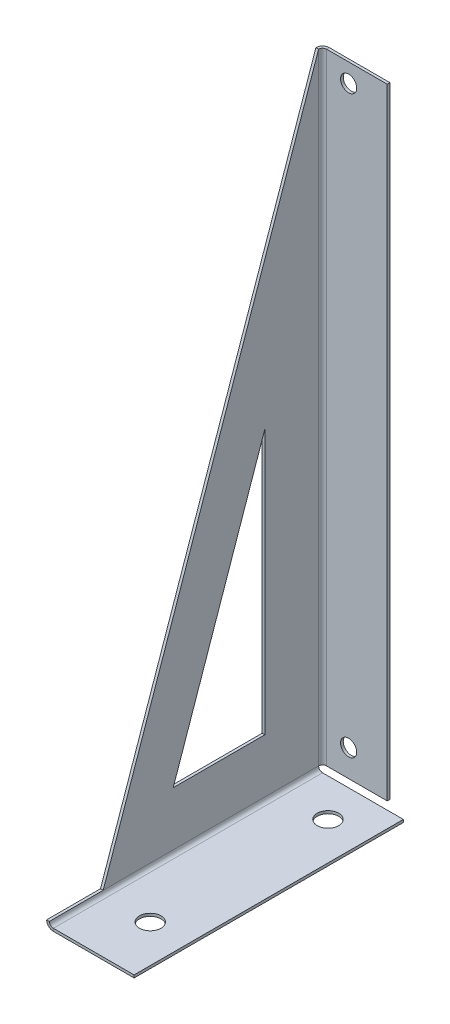
ISO-10303-21;
HEADER;
FILE_DESCRIPTION(('STEP AP214'),'2;1');
FILE_NAME('part.step','',(''),(''),'','','');
FILE_SCHEMA(('AUTOMOTIVE_DESIGN { 1 0 10303 214 1 1 1 1 }'));
ENDSEC;
DATA;
#1=APPLICATION_CONTEXT('core data for automotive mechanical design processes');
#2=APPLICATION_PROTOCOL_DEFINITION('international standard','automotive_design',2000,#1);
#3=PRODUCT_CONTEXT('',#1,'mechanical');
#4=PRODUCT('Part','Part','',(#3));
#5=PRODUCT_RELATED_PRODUCT_CATEGORY('part','',(#4));
#6=PRODUCT_DEFINITION_FORMATION('','',#4);
#7=PRODUCT_DEFINITION_CONTEXT('part definition',#1,'design');
#8=PRODUCT_DEFINITION('design','',#6,#7);
#9=PRODUCT_DEFINITION_SHAPE('','',#8);
#10=(LENGTH_UNIT() NAMED_UNIT(*) SI_UNIT(.MILLI.,.METRE.));
#11=(NAMED_UNIT(*) PLANE_ANGLE_UNIT() SI_UNIT($,.RADIAN.));
#12=(NAMED_UNIT(*) SI_UNIT($,.STERADIAN.) SOLID_ANGLE_UNIT());
#13=UNCERTAINTY_MEASURE_WITH_UNIT(LENGTH_MEASURE(1.E-05),#10,'distance_accuracy_value','');
#14=(GEOMETRIC_REPRESENTATION_CONTEXT(3) GLOBAL_UNCERTAINTY_ASSIGNED_CONTEXT((#13)) GLOBAL_UNIT_ASSIGNED_CONTEXT((#10,
#11,#12)) REPRESENTATION_CONTEXT('',''));
#15=CARTESIAN_POINT('',(0.,0.,0.));
#16=DIRECTION('',(0.,0.,1.));
#17=DIRECTION('',(1.,0.,0.));
#18=AXIS2_PLACEMENT_3D('',#15,#16,#17);
#19=CARTESIAN_POINT('',(-16.2366,0.,0.));
#20=DIRECTION('',(1.,0.,0.));
#21=DIRECTION('',(0.,1.,0.));
#22=AXIS2_PLACEMENT_3D('',#19,#20,#21);
#23=PLANE('',#22);
#24=DIRECTION('',(0.,0.,1.));
#25=VECTOR('',#24,1.);
#26=CARTESIAN_POINT('',(-16.2366,10.7366,10.));
#27=LINE('',#26,#25);
#28=CARTESIAN_POINT('',(-16.2366,10.7366,10.));
#29=VERTEX_POINT('',#28);
#30=CARTESIAN_POINT('',(-16.2366,10.7366,27.));
#31=VERTEX_POINT('',#30);
#32=EDGE_CURVE('E192',#29,#31,#27,.T.);
#33=ORIENTED_EDGE('',*,*,#32,.F.);
#34=DIRECTION('',(0.,-1.,0.));
#35=VECTOR('',#34,1.);
#36=CARTESIAN_POINT('',(-16.2366,10.7366,10.));
#37=LINE('',#36,#35);
#38=CARTESIAN_POINT('',(-16.2366000000002,59.8510916056831,10.));
#39=VERTEX_POINT('',#38);
#40=EDGE_CURVE('E91',#39,#29,#37,.T.);
#41=ORIENTED_EDGE('',*,*,#40,.F.);
#42=DIRECTION('',(0.,0.944993032891379,-0.32709045811022));
#43=VECTOR('',#42,1.);
#44=CARTESIAN_POINT('',(-16.2366000000002,59.8510916056831,10.));
#45=LINE('',#44,#43);
#46=EDGE_CURVE('E185',#31,#39,#45,.T.);
#47=ORIENTED_EDGE('',*,*,#46,.F.);
#48=EDGE_LOOP('',(#33,#41,#47));
#49=FACE_BOUND('',#48,.T.);
#50=DIRECTION('',(0.,0.944729559802012,-0.327850665450442));
#51=VECTOR('',#50,1.);
#52=CARTESIAN_POINT('',(-16.2366,12.4683828250105,35.9287049228079));
#53=LINE('',#52,#51);
#54=CARTESIAN_POINT('',(-16.2366,0.7366,40.));
#55=VERTEX_POINT('',#54);
#56=CARTESIAN_POINT('',(-16.2366000000003,116.,0.));
#57=VERTEX_POINT('',#56);
#58=EDGE_CURVE('E245',#55,#57,#53,.T.);
#59=ORIENTED_EDGE('',*,*,#58,.T.);
#60=DIRECTION('',(0.,-1.,0.));
#61=VECTOR('',#60,1.);
#62=CARTESIAN_POINT('',(-16.2366,0.,0.));
#63=LINE('',#62,#61);
#64=CARTESIAN_POINT('',(-16.2366,0.736599999999995,0.));
#65=VERTEX_POINT('',#64);
#66=EDGE_CURVE('E260',#57,#65,#63,.T.);
#67=ORIENTED_EDGE('',*,*,#66,.T.);
#68=DIRECTION('',(0.,0.,1.));
#69=VECTOR('',#68,1.);
#70=CARTESIAN_POINT('',(-16.2366,0.736599999999995,0.));
#71=LINE('',#70,#69);
#72=EDGE_CURVE('E268',#55,#65,#71,.F.);
#73=ORIENTED_EDGE('',*,*,#72,.F.);
#74=EDGE_LOOP('',(#59,#67,#73));
#75=FACE_BOUND('',#74,.T.);
#76=ADVANCED_FACE('F75',(#49,#75),#23,.F.);
#77=CARTESIAN_POINT('',(-15.7366,0.,0.));
#78=DIRECTION('',(1.,0.,0.));
#79=DIRECTION('',(0.,1.,0.));
#80=AXIS2_PLACEMENT_3D('',#77,#78,#79);
#81=PLANE('',#80);
#82=DIRECTION('',(0.,1.,0.));
#83=VECTOR('',#82,1.);
#84=CARTESIAN_POINT('',(-15.7366,0.,10.));
#85=LINE('',#84,#83);
#86=CARTESIAN_POINT('',(-15.7366,10.7366,10.));
#87=VERTEX_POINT('',#86);
#88=CARTESIAN_POINT('',(-15.7366000000001,59.8510916056831,10.));
#89=VERTEX_POINT('',#88);
#90=EDGE_CURVE('E13',#87,#89,#85,.T.);
#91=ORIENTED_EDGE('',*,*,#90,.F.);
#92=DIRECTION('',(0.,0.,-1.));
#93=VECTOR('',#92,1.);
#94=CARTESIAN_POINT('',(-15.7366,10.7366,0.));
#95=LINE('',#94,#93);
#96=CARTESIAN_POINT('',(-15.7366,10.7366,27.));
#97=VERTEX_POINT('',#96);
#98=EDGE_CURVE('E315',#97,#87,#95,.T.);
#99=ORIENTED_EDGE('',*,*,#98,.F.);
#100=DIRECTION('',(0.,-0.944993032891379,0.32709045811022));
#101=VECTOR('',#100,1.);
#102=CARTESIAN_POINT('',(-15.7366,9.49434067132322,27.4299832472472));
#103=LINE('',#102,#101);
#104=EDGE_CURVE('E84',#89,#97,#103,.T.);
#105=ORIENTED_EDGE('',*,*,#104,.F.);
#106=EDGE_LOOP('',(#91,#99,#105));
#107=FACE_BOUND('',#106,.T.);
#108=DIRECTION('',(0.,1.,0.));
#109=VECTOR('',#108,1.);
#110=CARTESIAN_POINT('',(-15.7366,0.,0.));
#111=LINE('',#110,#109);
#112=CARTESIAN_POINT('',(-15.7366000000003,116.,0.));
#113=VERTEX_POINT('',#112);
#114=CARTESIAN_POINT('',(-15.7366000000001,0.736600000000004,0.));
#115=VERTEX_POINT('',#114);
#116=EDGE_CURVE('E263',#113,#115,#111,.F.);
#117=ORIENTED_EDGE('',*,*,#116,.F.);
#118=DIRECTION('',(0.,0.944729559802012,-0.327850665450442));
#119=VECTOR('',#118,1.);
#120=CARTESIAN_POINT('',(-15.7366,12.4683828250105,35.9287049228079));
#121=LINE('',#120,#119);
#122=CARTESIAN_POINT('',(-15.7366000000002,0.736600000000002,40.));
#123=VERTEX_POINT('',#122);
#124=EDGE_CURVE('E249',#123,#113,#121,.T.);
#125=ORIENTED_EDGE('',*,*,#124,.F.);
#126=DIRECTION('',(0.,0.,1.));
#127=VECTOR('',#126,1.);
#128=CARTESIAN_POINT('',(-15.7366,0.736599999999997,0.));
#129=LINE('',#128,#127);
#130=EDGE_CURVE('E272',#115,#123,#129,.T.);
#131=ORIENTED_EDGE('',*,*,#130,.F.);
#132=EDGE_LOOP('',(#117,#125,#131));
#133=FACE_BOUND('',#132,.T.);
#134=ADVANCED_FACE('F326',(#107,#133),#81,.T.);
#135=CARTESIAN_POINT('',(-15.,-0.5,0.));
#136=DIRECTION('',(0.,0.,-1.));
#137=DIRECTION('',(-1.,0.,0.));
#138=AXIS2_PLACEMENT_3D('',#135,#136,#137);
#139=PLANE('',#138);
#140=DIRECTION('',(-1.,0.,0.));
#141=VECTOR('',#140,1.);
#142=CARTESIAN_POINT('',(-15.,0.,0.));
#143=LINE('',#142,#141);
#144=CARTESIAN_POINT('',(0.,0.,0.));
#145=VERTEX_POINT('',#144);
#146=CARTESIAN_POINT('',(-15.,0.,0.));
#147=VERTEX_POINT('',#146);
#148=EDGE_CURVE('E293',#145,#147,#143,.T.);
#149=ORIENTED_EDGE('',*,*,#148,.F.);
#150=DIRECTION('',(0.,1.,0.));
#151=VECTOR('',#150,1.);
#152=CARTESIAN_POINT('',(0.,-0.5,0.));
#153=LINE('',#152,#151);
#154=CARTESIAN_POINT('',(0.,-0.5,0.));
#155=VERTEX_POINT('',#154);
#156=EDGE_CURVE('E316',#155,#145,#153,.T.);
#157=ORIENTED_EDGE('',*,*,#156,.F.);
#158=DIRECTION('',(-1.,0.,0.));
#159=VECTOR('',#158,1.);
#160=CARTESIAN_POINT('',(-15.,-0.5,0.));
#161=LINE('',#160,#159);
#162=CARTESIAN_POINT('',(-15.,-0.5,0.));
#163=VERTEX_POINT('',#162);
#164=EDGE_CURVE('E299',#155,#163,#161,.T.);
#165=ORIENTED_EDGE('',*,*,#164,.T.);
#166=DIRECTION('',(0.,1.,0.));
#167=VECTOR('',#166,1.);
#168=CARTESIAN_POINT('',(-15.,-0.5,0.));
#169=LINE('',#168,#167);
#170=EDGE_CURVE('E313',#163,#147,#169,.T.);
#171=ORIENTED_EDGE('',*,*,#170,.T.);
#172=EDGE_LOOP('',(#149,#157,#165,#171));
#173=FACE_BOUND('',#172,.T.);
#174=ADVANCED_FACE('F329',(#173),#139,.T.);
#175=CARTESIAN_POINT('',(0.,-0.5,0.));
#176=DIRECTION('',(1.,0.,0.));
#177=DIRECTION('',(0.,0.,-1.));
#178=AXIS2_PLACEMENT_3D('',#175,#176,#177);
#179=PLANE('',#178);
#180=DIRECTION('',(0.,0.,-1.));
#181=VECTOR('',#180,1.);
#182=CARTESIAN_POINT('',(0.,0.,0.));
#183=LINE('',#182,#181);
#184=CARTESIAN_POINT('',(0.,0.,50.));
#185=VERTEX_POINT('',#184);
#186=EDGE_CURVE('E308',#185,#145,#183,.T.);
#187=ORIENTED_EDGE('',*,*,#186,.F.);
#188=DIRECTION('',(0.,1.,0.));
#189=VECTOR('',#188,1.);
#190=CARTESIAN_POINT('',(0.,-0.5,50.));
#191=LINE('',#190,#189);
#192=CARTESIAN_POINT('',(0.,-0.5,50.));
#193=VERTEX_POINT('',#192);
#194=EDGE_CURVE('E318',#193,#185,#191,.T.);
#195=ORIENTED_EDGE('',*,*,#194,.F.);
#196=DIRECTION('',(0.,0.,-1.));
#197=VECTOR('',#196,1.);
#198=CARTESIAN_POINT('',(0.,-0.5,0.));
#199=LINE('',#198,#197);
#200=EDGE_CURVE('E296',#193,#155,#199,.T.);
#201=ORIENTED_EDGE('',*,*,#200,.T.);
#202=ORIENTED_EDGE('',*,*,#156,.T.);
#203=EDGE_LOOP('',(#187,#195,#201,#202));
#204=FACE_BOUND('',#203,.T.);
#205=ADVANCED_FACE('F369',(#204),#179,.T.);
#206=CARTESIAN_POINT('',(-15.,-0.5,50.));
#207=DIRECTION('',(0.,0.,1.));
#208=DIRECTION('',(1.,0.,0.));
#209=AXIS2_PLACEMENT_3D('',#206,#207,#208);
#210=PLANE('',#209);
#211=DIRECTION('',(1.,0.,0.));
#212=VECTOR('',#211,1.);
#213=CARTESIAN_POINT('',(-15.,0.,50.));
#214=LINE('',#213,#212);
#215=CARTESIAN_POINT('',(-15.,0.,50.));
#216=VERTEX_POINT('',#215);
#217=EDGE_CURVE('E305',#216,#185,#214,.T.);
#218=ORIENTED_EDGE('',*,*,#217,.F.);
#219=DIRECTION('',(0.,1.,0.));
#220=VECTOR('',#219,1.);
#221=CARTESIAN_POINT('',(-15.,-0.5,50.));
#222=LINE('',#221,#220);
#223=CARTESIAN_POINT('',(-15.,-0.500000000000004,50.));
#224=VERTEX_POINT('',#223);
#225=EDGE_CURVE('E302',#224,#216,#222,.T.);
#226=ORIENTED_EDGE('',*,*,#225,.F.);
#227=DIRECTION('',(1.,0.,0.));
#228=VECTOR('',#227,1.);
#229=CARTESIAN_POINT('',(-15.,-0.5,50.));
#230=LINE('',#229,#228);
#231=EDGE_CURVE('E292',#224,#193,#230,.T.);
#232=ORIENTED_EDGE('',*,*,#231,.T.);
#233=ORIENTED_EDGE('',*,*,#194,.T.);
#234=EDGE_LOOP('',(#218,#226,#232,#233));
#235=FACE_BOUND('',#234,.T.);
#236=ADVANCED_FACE('F77',(#235),#210,.T.);
#237=CARTESIAN_POINT('',(0.,-0.5,0.));
#238=DIRECTION('',(0.,1.,0.));
#239=DIRECTION('',(0.,0.,1.));
#240=AXIS2_PLACEMENT_3D('',#237,#238,#239);
#241=PLANE('',#240);
#242=CARTESIAN_POINT('',(-6.99999999999999,-0.5,7.));
#243=DIRECTION('',(0.,1.,0.));
#244=DIRECTION('',(0.,0.,1.));
#245=AXIS2_PLACEMENT_3D('',#242,#243,#244);
#246=CIRCLE('',#245,2.);
#247=CARTESIAN_POINT('',(-6.99999999999999,-0.5,9.));
#248=VERTEX_POINT('',#247);
#249=EDGE_CURVE('E409',#248,#248,#246,.T.);
#250=ORIENTED_EDGE('',*,*,#249,.T.);
#251=EDGE_LOOP('',(#250));
#252=FACE_BOUND('',#251,.T.);
#253=CARTESIAN_POINT('',(-6.99999999999999,-0.5,40.));
#254=DIRECTION('',(0.,1.,0.));
#255=DIRECTION('',(0.,0.,1.));
#256=AXIS2_PLACEMENT_3D('',#253,#254,#255);
#257=CIRCLE('',#256,2.);
#258=CARTESIAN_POINT('',(-6.99999999999999,-0.5,42.));
#259=VERTEX_POINT('',#258);
#260=EDGE_CURVE('E408',#259,#259,#257,.T.);
#261=ORIENTED_EDGE('',*,*,#260,.T.);
#262=EDGE_LOOP('',(#261));
#263=FACE_BOUND('',#262,.T.);
#264=DIRECTION('',(0.,0.,1.));
#265=VECTOR('',#264,1.);
#266=CARTESIAN_POINT('',(-15.,-0.5,0.));
#267=LINE('',#266,#265);
#268=EDGE_CURVE('E289',#163,#224,#267,.T.);
#269=ORIENTED_EDGE('',*,*,#268,.F.);
#270=ORIENTED_EDGE('',*,*,#164,.F.);
#271=ORIENTED_EDGE('',*,*,#200,.F.);
#272=ORIENTED_EDGE('',*,*,#231,.F.);
#273=EDGE_LOOP('',(#269,#270,#271,#272));
#274=FACE_BOUND('',#273,.T.);
#275=ADVANCED_FACE('F364',(#252,#263,#274),#241,.F.);
#276=CARTESIAN_POINT('',(0.,0.,0.));
#277=DIRECTION('',(0.,1.,0.));
#278=DIRECTION('',(0.,0.,1.));
#279=AXIS2_PLACEMENT_3D('',#276,#277,#278);
#280=PLANE('',#279);
#281=CARTESIAN_POINT('',(-6.99999999999999,0.,7.));
#282=DIRECTION('',(0.,1.,0.));
#283=DIRECTION('',(0.,0.,1.));
#284=AXIS2_PLACEMENT_3D('',#281,#282,#283);
#285=CIRCLE('',#284,2.);
#286=CARTESIAN_POINT('',(-6.99999999999999,0.,9.));
#287=VERTEX_POINT('',#286);
#288=EDGE_CURVE('E403',#287,#287,#285,.T.);
#289=ORIENTED_EDGE('',*,*,#288,.F.);
#290=EDGE_LOOP('',(#289));
#291=FACE_BOUND('',#290,.T.);
#292=CARTESIAN_POINT('',(-6.99999999999999,0.,40.));
#293=DIRECTION('',(0.,1.,0.));
#294=DIRECTION('',(0.,0.,1.));
#295=AXIS2_PLACEMENT_3D('',#292,#293,#294);
#296=CIRCLE('',#295,2.);
#297=CARTESIAN_POINT('',(-6.99999999999999,0.,42.));
#298=VERTEX_POINT('',#297);
#299=EDGE_CURVE('E406',#298,#298,#296,.T.);
#300=ORIENTED_EDGE('',*,*,#299,.F.);
#301=EDGE_LOOP('',(#300));
#302=FACE_BOUND('',#301,.T.);
#303=DIRECTION('',(0.,0.,1.));
#304=VECTOR('',#303,1.);
#305=CARTESIAN_POINT('',(-15.,0.,0.));
#306=LINE('',#305,#304);
#307=EDGE_CURVE('E280',#147,#216,#306,.T.);
#308=ORIENTED_EDGE('',*,*,#307,.T.);
#309=ORIENTED_EDGE('',*,*,#217,.T.);
#310=ORIENTED_EDGE('',*,*,#186,.T.);
#311=ORIENTED_EDGE('',*,*,#148,.T.);
#312=EDGE_LOOP('',(#308,#309,#310,#311));
#313=FACE_BOUND('',#312,.T.);
#314=ADVANCED_FACE('F353',(#291,#302,#313),#280,.T.);
#315=CARTESIAN_POINT('',(-15.,0.7366,0.));
#316=DIRECTION('',(0.,0.,-1.));
#317=DIRECTION('',(-1.,0.,0.));
#318=AXIS2_PLACEMENT_3D('',#315,#316,#317);
#319=PLANE('',#318);
#320=DIRECTION('',(1.,0.,0.));
#321=VECTOR('',#320,1.);
#322=CARTESIAN_POINT('',(-16.2366,0.736599999999995,0.));
#323=LINE('',#322,#321);
#324=EDGE_CURVE('E256',#115,#65,#323,.F.);
#325=ORIENTED_EDGE('',*,*,#324,.F.);
#326=CARTESIAN_POINT('',(-15.,0.7366,0.));
#327=DIRECTION('',(0.,0.,1.));
#328=DIRECTION('',(1.,0.,0.));
#329=AXIS2_PLACEMENT_3D('',#326,#327,#328);
#330=CIRCLE('',#329,0.736600000000004);
#331=EDGE_CURVE('E284',#147,#115,#330,.F.);
#332=ORIENTED_EDGE('',*,*,#331,.F.);
#333=ORIENTED_EDGE('',*,*,#170,.F.);
#334=CARTESIAN_POINT('',(-15.,0.7366,0.));
#335=DIRECTION('',(0.,0.,1.));
#336=DIRECTION('',(1.,0.,0.));
#337=AXIS2_PLACEMENT_3D('',#334,#335,#336);
#338=CIRCLE('',#337,1.2366);
#339=EDGE_CURVE('E277',#163,#65,#338,.F.);
#340=ORIENTED_EDGE('',*,*,#339,.T.);
#341=EDGE_LOOP('',(#325,#332,#333,#340));
#342=FACE_BOUND('',#341,.T.);
#343=ADVANCED_FACE('F345',(#342),#319,.T.);
#344=CARTESIAN_POINT('',(-15.,0.7366,50.));
#345=DIRECTION('',(0.,0.,-1.));
#346=DIRECTION('',(-1.,0.,0.));
#347=AXIS2_PLACEMENT_3D('',#344,#345,#346);
#348=PLANE('',#347);
#349=CARTESIAN_POINT('',(-15.,0.7366,50.));
#350=DIRECTION('',(0.,0.,1.));
#351=DIRECTION('',(1.,0.,0.));
#352=AXIS2_PLACEMENT_3D('',#349,#350,#351);
#353=CIRCLE('',#352,0.736600000000004);
#354=CARTESIAN_POINT('',(-15.7366000000002,0.736599999999997,50.));
#355=VERTEX_POINT('',#354);
#356=EDGE_CURVE('E259',#355,#216,#353,.T.);
#357=ORIENTED_EDGE('',*,*,#356,.F.);
#358=DIRECTION('',(1.,0.,0.));
#359=VECTOR('',#358,1.);
#360=CARTESIAN_POINT('',(-15.7366,0.736599999999997,50.));
#361=LINE('',#360,#359);
#362=CARTESIAN_POINT('',(-16.2366,0.736599999999995,50.));
#363=VERTEX_POINT('',#362);
#364=EDGE_CURVE('E269',#355,#363,#361,.F.);
#365=ORIENTED_EDGE('',*,*,#364,.T.);
#366=CARTESIAN_POINT('',(-15.,0.7366,50.));
#367=DIRECTION('',(0.,0.,1.));
#368=DIRECTION('',(1.,0.,0.));
#369=AXIS2_PLACEMENT_3D('',#366,#367,#368);
#370=CIRCLE('',#369,1.2366);
#371=EDGE_CURVE('E281',#363,#224,#370,.T.);
#372=ORIENTED_EDGE('',*,*,#371,.T.);
#373=ORIENTED_EDGE('',*,*,#225,.T.);
#374=EDGE_LOOP('',(#357,#365,#372,#373));
#375=FACE_BOUND('',#374,.T.);
#376=ADVANCED_FACE('F357',(#375),#348,.F.);
#377=CARTESIAN_POINT('',(-15.,0.7366,50.));
#378=DIRECTION('',(0.,0.,1.));
#379=DIRECTION('',(-1.,0.,0.));
#380=AXIS2_PLACEMENT_3D('',#377,#378,#379);
#381=CYLINDRICAL_SURFACE('',#380,1.2366);
#382=ORIENTED_EDGE('',*,*,#268,.T.);
#383=ORIENTED_EDGE('',*,*,#371,.F.);
#384=EDGE_CURVE('E265',#363,#55,#71,.F.);
#385=ORIENTED_EDGE('',*,*,#384,.T.);
#386=ORIENTED_EDGE('',*,*,#72,.T.);
#387=ORIENTED_EDGE('',*,*,#339,.F.);
#388=EDGE_LOOP('',(#382,#383,#385,#386,#387));
#389=FACE_BOUND('',#388,.T.);
#390=ADVANCED_FACE('F361',(#389),#381,.T.);
#391=CARTESIAN_POINT('',(-15.,0.7366,50.));
#392=DIRECTION('',(0.,0.,1.));
#393=DIRECTION('',(-1.,0.,0.));
#394=AXIS2_PLACEMENT_3D('',#391,#392,#393);
#395=CYLINDRICAL_SURFACE('',#394,0.736600000000004);
#396=ORIENTED_EDGE('',*,*,#307,.F.);
#397=ORIENTED_EDGE('',*,*,#331,.T.);
#398=ORIENTED_EDGE('',*,*,#130,.T.);
#399=DIRECTION('',(0.,0.,1.));
#400=VECTOR('',#399,1.);
#401=CARTESIAN_POINT('',(-15.7366,0.736599999999997,0.));
#402=LINE('',#401,#400);
#403=EDGE_CURVE('E236',#123,#355,#402,.T.);
#404=ORIENTED_EDGE('',*,*,#403,.T.);
#405=ORIENTED_EDGE('',*,*,#356,.T.);
#406=EDGE_LOOP('',(#396,#397,#398,#404,#405));
#407=FACE_BOUND('',#406,.T.);
#408=ADVANCED_FACE('F350',(#407),#395,.F.);
#409=CARTESIAN_POINT('',(-15.7366,0.736599999999997,0.));
#410=DIRECTION('',(0.,1.,0.));
#411=DIRECTION('',(0.,0.,1.));
#412=AXIS2_PLACEMENT_3D('',#409,#410,#411);
#413=PLANE('',#412);
#414=ORIENTED_EDGE('',*,*,#364,.F.);
#415=ORIENTED_EDGE('',*,*,#403,.F.);
#416=DIRECTION('',(1.,0.,0.));
#417=VECTOR('',#416,1.);
#418=CARTESIAN_POINT('',(-15.7366000000002,0.736600000000002,40.));
#419=LINE('',#418,#417);
#420=EDGE_CURVE('E248',#123,#55,#419,.F.);
#421=ORIENTED_EDGE('',*,*,#420,.T.);
#422=ORIENTED_EDGE('',*,*,#384,.F.);
#423=EDGE_LOOP('',(#414,#415,#421,#422));
#424=FACE_BOUND('',#423,.T.);
#425=ADVANCED_FACE('F388',(#424),#413,.T.);
#426=CARTESIAN_POINT('',(-15.7366,12.4683828250105,35.9287049228079));
#427=DIRECTION('',(0.,-0.327850665450442,-0.944729559802012));
#428=DIRECTION('',(0.,0.944729559802012,-0.327850665450442));
#429=AXIS2_PLACEMENT_3D('',#426,#427,#428);
#430=PLANE('',#429);
#431=ORIENTED_EDGE('',*,*,#124,.T.);
#432=DIRECTION('',(1.,0.,0.));
#433=VECTOR('',#432,1.);
#434=CARTESIAN_POINT('',(-16.2366000000004,116.,0.));
#435=LINE('',#434,#433);
#436=EDGE_CURVE('E257',#57,#113,#435,.T.);
#437=ORIENTED_EDGE('',*,*,#436,.F.);
#438=ORIENTED_EDGE('',*,*,#58,.F.);
#439=ORIENTED_EDGE('',*,*,#420,.F.);
#440=EDGE_LOOP('',(#431,#437,#438,#439));
#441=FACE_BOUND('',#440,.T.);
#442=ADVANCED_FACE('F381',(#441),#430,.F.);
#443=CARTESIAN_POINT('',(-15.0000000000001,0.736600000000004,0.));
#444=DIRECTION('',(0.,-1.,0.));
#445=DIRECTION('',(1.,0.,0.));
#446=AXIS2_PLACEMENT_3D('',#443,#444,#445);
#447=PLANE('',#446);
#448=DIRECTION('',(0.,0.,1.));
#449=VECTOR('',#448,1.);
#450=CARTESIAN_POINT('',(-15.,0.7366,-1.2366));
#451=LINE('',#450,#449);
#452=CARTESIAN_POINT('',(-15.0000000000001,0.736600000000004,-0.7366));
#453=VERTEX_POINT('',#452);
#454=CARTESIAN_POINT('',(-15.0000000000001,0.736600000000004,-1.2366));
#455=VERTEX_POINT('',#454);
#456=EDGE_CURVE('E201',#453,#455,#451,.F.);
#457=ORIENTED_EDGE('',*,*,#456,.F.);
#458=CARTESIAN_POINT('',(-15.0000000000001,0.736600000000004,0.));
#459=DIRECTION('',(0.,1.,0.));
#460=DIRECTION('',(-1.,0.,0.));
#461=AXIS2_PLACEMENT_3D('',#458,#459,#460);
#462=CIRCLE('',#461,0.736599999999996);
#463=EDGE_CURVE('E240',#115,#453,#462,.F.);
#464=ORIENTED_EDGE('',*,*,#463,.F.);
#465=ORIENTED_EDGE('',*,*,#324,.T.);
#466=CARTESIAN_POINT('',(-15.0000000000001,0.736600000000004,0.));
#467=DIRECTION('',(0.,1.,0.));
#468=DIRECTION('',(-1.,0.,0.));
#469=AXIS2_PLACEMENT_3D('',#466,#467,#468);
#470=CIRCLE('',#469,1.2366);
#471=EDGE_CURVE('E233',#65,#455,#470,.F.);
#472=ORIENTED_EDGE('',*,*,#471,.T.);
#473=EDGE_LOOP('',(#457,#464,#465,#472));
#474=FACE_BOUND('',#473,.T.);
#475=ADVANCED_FACE('F341',(#474),#447,.T.);
#476=CARTESIAN_POINT('',(-15.0000000000003,116.,0.));
#477=DIRECTION('',(0.,-1.,0.));
#478=DIRECTION('',(1.,0.,0.));
#479=AXIS2_PLACEMENT_3D('',#476,#477,#478);
#480=PLANE('',#479);
#481=CARTESIAN_POINT('',(-15.0000000000003,116.,0.));
#482=DIRECTION('',(0.,1.,0.));
#483=DIRECTION('',(-1.,0.,0.));
#484=AXIS2_PLACEMENT_3D('',#481,#482,#483);
#485=CIRCLE('',#484,0.736599999999996);
#486=CARTESIAN_POINT('',(-15.0000000000003,116.,-0.736599999999992));
#487=VERTEX_POINT('',#486);
#488=EDGE_CURVE('E206',#487,#113,#485,.T.);
#489=ORIENTED_EDGE('',*,*,#488,.F.);
#490=DIRECTION('',(0.,0.,1.));
#491=VECTOR('',#490,1.);
#492=CARTESIAN_POINT('',(-15.0000000000004,116.,-0.736600000000001));
#493=LINE('',#492,#491);
#494=CARTESIAN_POINT('',(-15.0000000000004,116.,-1.2366));
#495=VERTEX_POINT('',#494);
#496=EDGE_CURVE('E226',#487,#495,#493,.F.);
#497=ORIENTED_EDGE('',*,*,#496,.T.);
#498=CARTESIAN_POINT('',(-15.0000000000003,116.,0.));
#499=DIRECTION('',(0.,1.,0.));
#500=DIRECTION('',(-1.,0.,0.));
#501=AXIS2_PLACEMENT_3D('',#498,#499,#500);
#502=CIRCLE('',#501,1.2366);
#503=EDGE_CURVE('E237',#495,#57,#502,.T.);
#504=ORIENTED_EDGE('',*,*,#503,.T.);
#505=ORIENTED_EDGE('',*,*,#436,.T.);
#506=EDGE_LOOP('',(#489,#497,#504,#505));
#507=FACE_BOUND('',#506,.T.);
#508=ADVANCED_FACE('F448',(#507),#480,.F.);
#509=CARTESIAN_POINT('',(-15.0000000000003,116.,0.));
#510=DIRECTION('',(0.,1.,0.));
#511=DIRECTION('',(0.,0.,-1.));
#512=AXIS2_PLACEMENT_3D('',#509,#510,#511);
#513=CYLINDRICAL_SURFACE('',#512,1.2366);
#514=ORIENTED_EDGE('',*,*,#66,.F.);
#515=ORIENTED_EDGE('',*,*,#503,.F.);
#516=DIRECTION('',(0.,1.,0.));
#517=VECTOR('',#516,1.);
#518=CARTESIAN_POINT('',(-15.,0.736600000000018,-1.2366));
#519=LINE('',#518,#517);
#520=EDGE_CURVE('E224',#495,#455,#519,.F.);
#521=ORIENTED_EDGE('',*,*,#520,.T.);
#522=ORIENTED_EDGE('',*,*,#471,.F.);
#523=EDGE_LOOP('',(#514,#515,#521,#522));
#524=FACE_BOUND('',#523,.T.);
#525=ADVANCED_FACE('F454',(#524),#513,.T.);
#526=CARTESIAN_POINT('',(-15.0000000000003,116.,0.));
#527=DIRECTION('',(0.,1.,0.));
#528=DIRECTION('',(0.,0.,-1.));
#529=AXIS2_PLACEMENT_3D('',#526,#527,#528);
#530=CYLINDRICAL_SURFACE('',#529,0.736599999999996);
#531=ORIENTED_EDGE('',*,*,#116,.T.);
#532=ORIENTED_EDGE('',*,*,#463,.T.);
#533=DIRECTION('',(0.,1.,0.));
#534=VECTOR('',#533,1.);
#535=CARTESIAN_POINT('',(-15.,0.736600000000018,-0.7366));
#536=LINE('',#535,#534);
#537=EDGE_CURVE('E229',#453,#487,#536,.T.);
#538=ORIENTED_EDGE('',*,*,#537,.T.);
#539=ORIENTED_EDGE('',*,*,#488,.T.);
#540=EDGE_LOOP('',(#531,#532,#538,#539));
#541=FACE_BOUND('',#540,.T.);
#542=ADVANCED_FACE('F336',(#541),#530,.F.);
#543=CARTESIAN_POINT('',(-3.7366000000004,116.,-1.23660000000004));
#544=DIRECTION('',(0.,-1.,0.));
#545=DIRECTION('',(1.,0.,0.));
#546=AXIS2_PLACEMENT_3D('',#543,#544,#545);
#547=PLANE('',#546);
#548=ORIENTED_EDGE('',*,*,#496,.F.);
#549=DIRECTION('',(-1.,0.,0.));
#550=VECTOR('',#549,1.);
#551=CARTESIAN_POINT('',(-3.7366000000004,116.,-0.736600000000041));
#552=LINE('',#551,#550);
#553=CARTESIAN_POINT('',(-3.7366000000004,116.,-0.736600000000041));
#554=VERTEX_POINT('',#553);
#555=EDGE_CURVE('E222',#487,#554,#552,.F.);
#556=ORIENTED_EDGE('',*,*,#555,.T.);
#557=DIRECTION('',(0.,0.,1.));
#558=VECTOR('',#557,1.);
#559=CARTESIAN_POINT('',(-3.7366000000004,116.,-1.23660000000004));
#560=LINE('',#559,#558);
#561=CARTESIAN_POINT('',(-3.7366000000004,116.,-1.23660000000004));
#562=VERTEX_POINT('',#561);
#563=EDGE_CURVE('E203',#562,#554,#560,.T.);
#564=ORIENTED_EDGE('',*,*,#563,.F.);
#565=DIRECTION('',(1.,0.,0.));
#566=VECTOR('',#565,1.);
#567=CARTESIAN_POINT('',(-2.70221252022333E-13,116.,-1.23660000000005));
#568=LINE('',#567,#566);
#569=EDGE_CURVE('E215',#495,#562,#568,.T.);
#570=ORIENTED_EDGE('',*,*,#569,.F.);
#571=EDGE_LOOP('',(#548,#556,#564,#570));
#572=FACE_BOUND('',#571,.T.);
#573=ADVANCED_FACE('F444',(#572),#547,.F.);
#574=CARTESIAN_POINT('',(-15.7366,0.736599999999997,-1.2366));
#575=DIRECTION('',(0.,1.,0.));
#576=DIRECTION('',(-1.,0.,0.));
#577=AXIS2_PLACEMENT_3D('',#574,#575,#576);
#578=PLANE('',#577);
#579=ORIENTED_EDGE('',*,*,#456,.T.);
#580=DIRECTION('',(-1.,0.,0.));
#581=VECTOR('',#580,1.);
#582=CARTESIAN_POINT('',(0.,0.736600000000051,-1.23660000000005));
#583=LINE('',#582,#581);
#584=CARTESIAN_POINT('',(-3.7366,0.736600000000039,-1.23660000000004));
#585=VERTEX_POINT('',#584);
#586=EDGE_CURVE('E210',#585,#455,#583,.T.);
#587=ORIENTED_EDGE('',*,*,#586,.F.);
#588=DIRECTION('',(0.,0.,1.));
#589=VECTOR('',#588,1.);
#590=CARTESIAN_POINT('',(-3.7366,0.736600000000039,-1.23660000000004));
#591=LINE('',#590,#589);
#592=CARTESIAN_POINT('',(-3.7366,0.736600000000039,-0.736600000000041));
#593=VERTEX_POINT('',#592);
#594=EDGE_CURVE('E207',#585,#593,#591,.T.);
#595=ORIENTED_EDGE('',*,*,#594,.T.);
#596=DIRECTION('',(1.,0.,0.));
#597=VECTOR('',#596,1.);
#598=CARTESIAN_POINT('',(-15.7366,0.736599999999997,-0.736599999999997));
#599=LINE('',#598,#597);
#600=EDGE_CURVE('E217',#593,#453,#599,.F.);
#601=ORIENTED_EDGE('',*,*,#600,.T.);
#602=EDGE_LOOP('',(#579,#587,#595,#601));
#603=FACE_BOUND('',#602,.T.);
#604=ADVANCED_FACE('F456',(#603),#578,.F.);
#605=CARTESIAN_POINT('',(0.,0.,-1.23660000000005));
#606=DIRECTION('',(0.,0.,1.));
#607=DIRECTION('',(1.,0.,0.));
#608=AXIS2_PLACEMENT_3D('',#605,#606,#607);
#609=PLANE('',#608);
#610=CARTESIAN_POINT('',(-10.9000000000004,112.5366,-1.23660000000001));
#611=DIRECTION('',(0.,0.,1.));
#612=DIRECTION('',(1.,0.,0.));
#613=AXIS2_PLACEMENT_3D('',#610,#611,#612);
#614=CIRCLE('',#613,1.5);
#615=CARTESIAN_POINT('',(-9.4000000000004,112.5366,-1.23660000000002));
#616=VERTEX_POINT('',#615);
#617=EDGE_CURVE('E420',#616,#616,#614,.T.);
#618=ORIENTED_EDGE('',*,*,#617,.T.);
#619=EDGE_LOOP('',(#618));
#620=FACE_BOUND('',#619,.T.);
#621=CARTESIAN_POINT('',(-10.9000000000001,5.7366,-1.23660000000002));
#622=DIRECTION('',(0.,0.,-1.));
#623=DIRECTION('',(-1.,0.,0.));
#624=AXIS2_PLACEMENT_3D('',#621,#622,#623);
#625=CIRCLE('',#624,1.5);
#626=CARTESIAN_POINT('',(-12.4000000000001,5.7366,-1.23660000000001));
#627=VERTEX_POINT('',#626);
#628=EDGE_CURVE('E423',#627,#627,#625,.T.);
#629=ORIENTED_EDGE('',*,*,#628,.F.);
#630=EDGE_LOOP('',(#629));
#631=FACE_BOUND('',#630,.T.);
#632=ORIENTED_EDGE('',*,*,#520,.F.);
#633=ORIENTED_EDGE('',*,*,#569,.T.);
#634=DIRECTION('',(0.,-1.,0.));
#635=VECTOR('',#634,1.);
#636=CARTESIAN_POINT('',(-3.7366,0.,-1.23660000000004));
#637=LINE('',#636,#635);
#638=EDGE_CURVE('E213',#562,#585,#637,.T.);
#639=ORIENTED_EDGE('',*,*,#638,.T.);
#640=ORIENTED_EDGE('',*,*,#586,.T.);
#641=EDGE_LOOP('',(#632,#633,#639,#640));
#642=FACE_BOUND('',#641,.T.);
#643=ADVANCED_FACE('F435',(#620,#631,#642),#609,.F.);
#644=CARTESIAN_POINT('',(0.,0.,-0.736600000000055));
#645=DIRECTION('',(0.,0.,1.));
#646=DIRECTION('',(1.,0.,0.));
#647=AXIS2_PLACEMENT_3D('',#644,#645,#646);
#648=PLANE('',#647);
#649=CARTESIAN_POINT('',(-10.9000000000004,112.5366,-0.736600000000055));
#650=DIRECTION('',(0.,0.,1.));
#651=DIRECTION('',(1.,0.,0.));
#652=AXIS2_PLACEMENT_3D('',#649,#650,#651);
#653=CIRCLE('',#652,1.5);
#654=CARTESIAN_POINT('',(-9.4000000000004,112.5366,-0.736600000000055));
#655=VERTEX_POINT('',#654);
#656=EDGE_CURVE('E412',#655,#655,#653,.T.);
#657=ORIENTED_EDGE('',*,*,#656,.F.);
#658=EDGE_LOOP('',(#657));
#659=FACE_BOUND('',#658,.T.);
#660=CARTESIAN_POINT('',(-10.9000000000001,5.7366,-0.736600000000014));
#661=DIRECTION('',(0.,0.,1.));
#662=DIRECTION('',(1.,0.,0.));
#663=AXIS2_PLACEMENT_3D('',#660,#661,#662);
#664=CIRCLE('',#663,1.5);
#665=CARTESIAN_POINT('',(-9.40000000000007,5.7366,-0.73660000000002));
#666=VERTEX_POINT('',#665);
#667=EDGE_CURVE('E79',#666,#666,#664,.T.);
#668=ORIENTED_EDGE('',*,*,#667,.F.);
#669=EDGE_LOOP('',(#668));
#670=FACE_BOUND('',#669,.T.);
#671=ORIENTED_EDGE('',*,*,#555,.F.);
#672=ORIENTED_EDGE('',*,*,#537,.F.);
#673=ORIENTED_EDGE('',*,*,#600,.F.);
#674=DIRECTION('',(0.,1.,0.));
#675=VECTOR('',#674,1.);
#676=CARTESIAN_POINT('',(-3.7366,0.736600000000039,-0.736600000000041));
#677=LINE('',#676,#675);
#678=EDGE_CURVE('E220',#554,#593,#677,.F.);
#679=ORIENTED_EDGE('',*,*,#678,.F.);
#680=EDGE_LOOP('',(#671,#672,#673,#679));
#681=FACE_BOUND('',#680,.T.);
#682=ADVANCED_FACE('F431',(#659,#670,#681),#648,.T.);
#683=CARTESIAN_POINT('',(-3.7366,0.736600000000039,-1.23660000000004));
#684=DIRECTION('',(-1.,0.,0.));
#685=DIRECTION('',(0.,0.,1.));
#686=AXIS2_PLACEMENT_3D('',#683,#684,#685);
#687=PLANE('',#686);
#688=ORIENTED_EDGE('',*,*,#678,.T.);
#689=ORIENTED_EDGE('',*,*,#594,.F.);
#690=ORIENTED_EDGE('',*,*,#638,.F.);
#691=ORIENTED_EDGE('',*,*,#563,.T.);
#692=EDGE_LOOP('',(#688,#689,#690,#691));
#693=FACE_BOUND('',#692,.T.);
#694=ADVANCED_FACE('F434',(#693),#687,.F.);
#695=CARTESIAN_POINT('',(-6.23660000000003,10.7366,10.));
#696=DIRECTION('',(0.,0.,-1.));
#697=DIRECTION('',(-1.,0.,0.));
#698=AXIS2_PLACEMENT_3D('',#695,#696,#697);
#699=PLANE('',#698);
#700=ORIENTED_EDGE('',*,*,#90,.T.);
#701=DIRECTION('',(-1.,0.,0.));
#702=VECTOR('',#701,1.);
#703=CARTESIAN_POINT('',(-6.2366000000002,59.8510916056831,10.));
#704=LINE('',#703,#702);
#705=EDGE_CURVE('E188',#89,#39,#704,.T.);
#706=ORIENTED_EDGE('',*,*,#705,.T.);
#707=ORIENTED_EDGE('',*,*,#40,.T.);
#708=DIRECTION('',(-1.,0.,0.));
#709=VECTOR('',#708,1.);
#710=CARTESIAN_POINT('',(-6.23660000000003,10.7366,10.));
#711=LINE('',#710,#709);
#712=EDGE_CURVE('E189',#87,#29,#711,.T.);
#713=ORIENTED_EDGE('',*,*,#712,.F.);
#714=EDGE_LOOP('',(#700,#706,#707,#713));
#715=FACE_BOUND('',#714,.T.);
#716=ADVANCED_FACE('F325',(#715),#699,.F.);
#717=CARTESIAN_POINT('',(-6.2366000000002,59.8510916056831,10.));
#718=DIRECTION('',(0.,0.32709045811022,0.944993032891379));
#719=DIRECTION('',(0.,-0.944993032891379,0.32709045811022));
#720=AXIS2_PLACEMENT_3D('',#717,#718,#719);
#721=PLANE('',#720);
#722=ORIENTED_EDGE('',*,*,#104,.T.);
#723=DIRECTION('',(-1.,0.,0.));
#724=VECTOR('',#723,1.);
#725=CARTESIAN_POINT('',(-6.23660000000003,10.7366,27.));
#726=LINE('',#725,#724);
#727=EDGE_CURVE('E99',#97,#31,#726,.T.);
#728=ORIENTED_EDGE('',*,*,#727,.T.);
#729=ORIENTED_EDGE('',*,*,#46,.T.);
#730=ORIENTED_EDGE('',*,*,#705,.F.);
#731=EDGE_LOOP('',(#722,#728,#729,#730));
#732=FACE_BOUND('',#731,.T.);
#733=ADVANCED_FACE('F182',(#732),#721,.F.);
#734=CARTESIAN_POINT('',(-6.23660000000003,10.7366,10.));
#735=DIRECTION('',(0.,-1.,0.));
#736=DIRECTION('',(1.,0.,0.));
#737=AXIS2_PLACEMENT_3D('',#734,#735,#736);
#738=PLANE('',#737);
#739=ORIENTED_EDGE('',*,*,#98,.T.);
#740=ORIENTED_EDGE('',*,*,#712,.T.);
#741=ORIENTED_EDGE('',*,*,#32,.T.);
#742=ORIENTED_EDGE('',*,*,#727,.F.);
#743=EDGE_LOOP('',(#739,#740,#741,#742));
#744=FACE_BOUND('',#743,.T.);
#745=ADVANCED_FACE('F193',(#744),#738,.F.);
#746=CARTESIAN_POINT('',(-10.9,5.7366,8.76339999999998));
#747=DIRECTION('',(0.,0.,-1.));
#748=DIRECTION('',(-1.,0.,0.));
#749=AXIS2_PLACEMENT_3D('',#746,#747,#748);
#750=CYLINDRICAL_SURFACE('',#749,1.5);
#751=ORIENTED_EDGE('',*,*,#667,.T.);
#752=EDGE_LOOP('',(#751));
#753=FACE_BOUND('',#752,.T.);
#754=ORIENTED_EDGE('',*,*,#628,.T.);
#755=EDGE_LOOP('',(#754));
#756=FACE_BOUND('',#755,.T.);
#757=ADVANCED_FACE('F428',(#753,#756),#750,.F.);
#758=CARTESIAN_POINT('',(-10.9000000000004,112.5366,-10.7366000000001));
#759=DIRECTION('',(0.,0.,1.));
#760=DIRECTION('',(1.,0.,0.));
#761=AXIS2_PLACEMENT_3D('',#758,#759,#760);
#762=CYLINDRICAL_SURFACE('',#761,1.5);
#763=ORIENTED_EDGE('',*,*,#656,.T.);
#764=EDGE_LOOP('',(#763));
#765=FACE_BOUND('',#764,.T.);
#766=ORIENTED_EDGE('',*,*,#617,.F.);
#767=EDGE_LOOP('',(#766));
#768=FACE_BOUND('',#767,.T.);
#769=ADVANCED_FACE('F531',(#765,#768),#762,.F.);
#770=CARTESIAN_POINT('',(-6.99999999999999,-12.,40.));
#771=DIRECTION('',(0.,1.,0.));
#772=DIRECTION('',(0.,0.,1.));
#773=AXIS2_PLACEMENT_3D('',#770,#771,#772);
#774=CYLINDRICAL_SURFACE('',#773,2.);
#775=ORIENTED_EDGE('',*,*,#299,.T.);
#776=EDGE_LOOP('',(#775));
#777=FACE_BOUND('',#776,.T.);
#778=ORIENTED_EDGE('',*,*,#260,.F.);
#779=EDGE_LOOP('',(#778));
#780=FACE_BOUND('',#779,.T.);
#781=ADVANCED_FACE('F536',(#777,#780),#774,.F.);
#782=CARTESIAN_POINT('',(-6.99999999999999,-12.,7.));
#783=DIRECTION('',(0.,1.,0.));
#784=DIRECTION('',(0.,0.,1.));
#785=AXIS2_PLACEMENT_3D('',#782,#783,#784);
#786=CYLINDRICAL_SURFACE('',#785,2.);
#787=ORIENTED_EDGE('',*,*,#288,.T.);
#788=EDGE_LOOP('',(#787));
#789=FACE_BOUND('',#788,.T.);
#790=ORIENTED_EDGE('',*,*,#249,.F.);
#791=EDGE_LOOP('',(#790));
#792=FACE_BOUND('',#791,.T.);
#793=ADVANCED_FACE('F549',(#789,#792),#786,.F.);
#794=CLOSED_SHELL('',(#76,#134,#174,#205,#236,#275,#314,#343,#376,#390,#408,#425,#442,#475,#508,
#525,#542,#573,#604,#643,#682,#694,#716,#733,#745,#757,#769,#781,#793));
#795=MANIFOLD_SOLID_BREP('B2',#794);
#796=ADVANCED_BREP_SHAPE_REPRESENTATION('',(#18,#795),#14);
#797=SHAPE_DEFINITION_REPRESENTATION(#9,#796);
ENDSEC;
END-ISO-10303-21;
